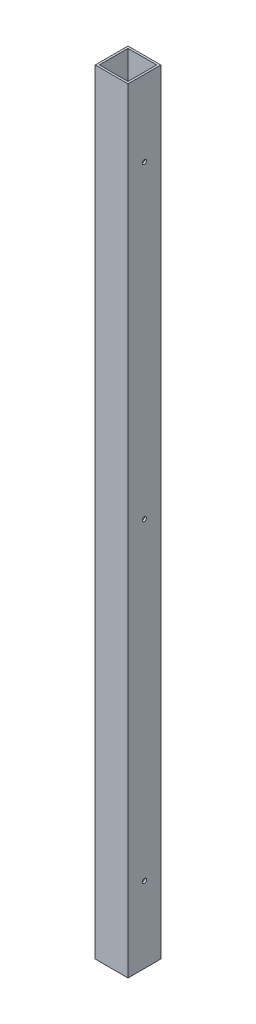
ISO-10303-21;
HEADER;
FILE_DESCRIPTION(('STEP AP214'),'2;1');
FILE_NAME('part.step','',(''),(''),'','','');
FILE_SCHEMA(('AUTOMOTIVE_DESIGN { 1 0 10303 214 1 1 1 1 }'));
ENDSEC;
DATA;
#1=APPLICATION_CONTEXT('core data for automotive mechanical design processes');
#2=APPLICATION_PROTOCOL_DEFINITION('international standard','automotive_design',2000,#1);
#3=PRODUCT_CONTEXT('',#1,'mechanical');
#4=PRODUCT('Part','Part','',(#3));
#5=PRODUCT_RELATED_PRODUCT_CATEGORY('part','',(#4));
#6=PRODUCT_DEFINITION_FORMATION('','',#4);
#7=PRODUCT_DEFINITION_CONTEXT('part definition',#1,'design');
#8=PRODUCT_DEFINITION('design','',#6,#7);
#9=PRODUCT_DEFINITION_SHAPE('','',#8);
#10=(LENGTH_UNIT() NAMED_UNIT(*) SI_UNIT(.MILLI.,.METRE.));
#11=(NAMED_UNIT(*) PLANE_ANGLE_UNIT() SI_UNIT($,.RADIAN.));
#12=(NAMED_UNIT(*) SI_UNIT($,.STERADIAN.) SOLID_ANGLE_UNIT());
#13=UNCERTAINTY_MEASURE_WITH_UNIT(LENGTH_MEASURE(1.E-05),#10,'distance_accuracy_value','');
#14=(GEOMETRIC_REPRESENTATION_CONTEXT(3) GLOBAL_UNCERTAINTY_ASSIGNED_CONTEXT((#13)) GLOBAL_UNIT_ASSIGNED_CONTEXT((#10,
#11,#12)) REPRESENTATION_CONTEXT('',''));
#15=CARTESIAN_POINT('',(0.,0.,0.));
#16=DIRECTION('',(0.,0.,1.));
#17=DIRECTION('',(1.,0.,0.));
#18=AXIS2_PLACEMENT_3D('',#15,#16,#17);
#19=CARTESIAN_POINT('',(0.,1200.14999999999,0.));
#20=DIRECTION('',(0.,0.999999999999993,0.));
#21=DIRECTION('',(0.,0.,0.999999999999993));
#22=AXIS2_PLACEMENT_3D('',#19,#20,#21);
#23=PLANE('',#22);
#24=DIRECTION('',(0.,0.,0.999999999999993));
#25=VECTOR('',#24,1.);
#26=CARTESIAN_POINT('',(-25.4000000000002,1200.14999999999,25.3999999999998));
#27=LINE('',#26,#25);
#28=CARTESIAN_POINT('',(-25.4,1200.14999999999,-25.3999999999998));
#29=VERTEX_POINT('',#28);
#30=CARTESIAN_POINT('',(-25.4000000000002,1200.14999999999,25.3999999999998));
#31=VERTEX_POINT('',#30);
#32=EDGE_CURVE('E139',#29,#31,#27,.T.);
#33=ORIENTED_EDGE('',*,*,#32,.T.);
#34=DIRECTION('',(1.,0.,0.));
#35=VECTOR('',#34,1.);
#36=CARTESIAN_POINT('',(25.3999999999998,1200.14999999999,25.3999999999998));
#37=LINE('',#36,#35);
#38=CARTESIAN_POINT('',(25.3999999999998,1200.14999999999,25.3999999999998));
#39=VERTEX_POINT('',#38);
#40=EDGE_CURVE('E142',#31,#39,#37,.T.);
#41=ORIENTED_EDGE('',*,*,#40,.T.);
#42=DIRECTION('',(0.,0.,-0.999999999999993));
#43=VECTOR('',#42,1.);
#44=CARTESIAN_POINT('',(25.3999999999998,1200.14999999999,25.3999999999998));
#45=LINE('',#44,#43);
#46=CARTESIAN_POINT('',(25.4,1200.14999999999,-25.3999999999998));
#47=VERTEX_POINT('',#46);
#48=EDGE_CURVE('E145',#39,#47,#45,.T.);
#49=ORIENTED_EDGE('',*,*,#48,.T.);
#50=DIRECTION('',(-1.,0.,0.));
#51=VECTOR('',#50,1.);
#52=CARTESIAN_POINT('',(25.4,1200.14999999999,-25.3999999999998));
#53=LINE('',#52,#51);
#54=EDGE_CURVE('E147',#47,#29,#53,.T.);
#55=ORIENTED_EDGE('',*,*,#54,.T.);
#56=EDGE_LOOP('',(#33,#41,#49,#55));
#57=FACE_BOUND('',#56,.T.);
#58=DIRECTION('',(0.,0.,-0.999999999999993));
#59=VECTOR('',#58,1.);
#60=CARTESIAN_POINT('',(22.2249999999997,1200.14999999999,22.2249999999998));
#61=LINE('',#60,#59);
#62=CARTESIAN_POINT('',(22.2249999999997,1200.14999999999,22.2249999999998));
#63=VERTEX_POINT('',#62);
#64=CARTESIAN_POINT('',(22.225,1200.14999999999,-22.2249999999999));
#65=VERTEX_POINT('',#64);
#66=EDGE_CURVE('E109',#63,#65,#61,.T.);
#67=ORIENTED_EDGE('',*,*,#66,.F.);
#68=DIRECTION('',(1.,0.,0.));
#69=VECTOR('',#68,1.);
#70=CARTESIAN_POINT('',(22.2249999999997,1200.14999999999,22.2249999999998));
#71=LINE('',#70,#69);
#72=CARTESIAN_POINT('',(-22.2250000000002,1200.14999999999,22.2249999999999));
#73=VERTEX_POINT('',#72);
#74=EDGE_CURVE('E101',#73,#63,#71,.T.);
#75=ORIENTED_EDGE('',*,*,#74,.F.);
#76=DIRECTION('',(0.,0.,0.999999999999993));
#77=VECTOR('',#76,1.);
#78=CARTESIAN_POINT('',(-22.2250000000002,1200.14999999999,22.2249999999999));
#79=LINE('',#78,#77);
#80=CARTESIAN_POINT('',(-22.225,1200.14999999999,-22.2249999999998));
#81=VERTEX_POINT('',#80);
#82=EDGE_CURVE('E123',#81,#73,#79,.T.);
#83=ORIENTED_EDGE('',*,*,#82,.F.);
#84=DIRECTION('',(-1.,0.,0.));
#85=VECTOR('',#84,1.);
#86=CARTESIAN_POINT('',(22.225,1200.14999999999,-22.2249999999999));
#87=LINE('',#86,#85);
#88=EDGE_CURVE('E121',#65,#81,#87,.T.);
#89=ORIENTED_EDGE('',*,*,#88,.F.);
#90=EDGE_LOOP('',(#67,#75,#83,#89));
#91=FACE_BOUND('',#90,.T.);
#92=ADVANCED_FACE('F34',(#57,#91),#23,.T.);
#93=CARTESIAN_POINT('',(0.,0.,0.));
#94=DIRECTION('',(0.,0.999999999999993,0.));
#95=DIRECTION('',(0.,0.,0.999999999999993));
#96=AXIS2_PLACEMENT_3D('',#93,#94,#95);
#97=PLANE('',#96);
#98=DIRECTION('',(0.,0.,0.999999999999993));
#99=VECTOR('',#98,1.);
#100=CARTESIAN_POINT('',(-25.4,0.,25.3999999999998));
#101=LINE('',#100,#99);
#102=CARTESIAN_POINT('',(-25.4,0.,-25.3999999999998));
#103=VERTEX_POINT('',#102);
#104=CARTESIAN_POINT('',(-25.4,0.,25.3999999999998));
#105=VERTEX_POINT('',#104);
#106=EDGE_CURVE('E117',#103,#105,#101,.T.);
#107=ORIENTED_EDGE('',*,*,#106,.F.);
#108=DIRECTION('',(-1.,0.,0.));
#109=VECTOR('',#108,1.);
#110=CARTESIAN_POINT('',(25.4,0.,-25.3999999999998));
#111=LINE('',#110,#109);
#112=CARTESIAN_POINT('',(25.4,0.,-25.3999999999998));
#113=VERTEX_POINT('',#112);
#114=EDGE_CURVE('E143',#113,#103,#111,.T.);
#115=ORIENTED_EDGE('',*,*,#114,.F.);
#116=DIRECTION('',(0.,0.,-0.999999999999993));
#117=VECTOR('',#116,1.);
#118=CARTESIAN_POINT('',(25.4,0.,25.3999999999998));
#119=LINE('',#118,#117);
#120=CARTESIAN_POINT('',(25.4,0.,25.3999999999998));
#121=VERTEX_POINT('',#120);
#122=EDGE_CURVE('E154',#121,#113,#119,.T.);
#123=ORIENTED_EDGE('',*,*,#122,.F.);
#124=DIRECTION('',(1.,0.,0.));
#125=VECTOR('',#124,1.);
#126=CARTESIAN_POINT('',(25.4,0.,25.3999999999998));
#127=LINE('',#126,#125);
#128=EDGE_CURVE('E152',#105,#121,#127,.T.);
#129=ORIENTED_EDGE('',*,*,#128,.F.);
#130=EDGE_LOOP('',(#107,#115,#123,#129));
#131=FACE_BOUND('',#130,.T.);
#132=DIRECTION('',(1.,0.,0.));
#133=VECTOR('',#132,1.);
#134=CARTESIAN_POINT('',(22.225,0.,22.2249999999999));
#135=LINE('',#134,#133);
#136=CARTESIAN_POINT('',(-22.225,0.,22.2249999999998));
#137=VERTEX_POINT('',#136);
#138=CARTESIAN_POINT('',(22.225,0.,22.2249999999999));
#139=VERTEX_POINT('',#138);
#140=EDGE_CURVE('E59',#137,#139,#135,.T.);
#141=ORIENTED_EDGE('',*,*,#140,.T.);
#142=DIRECTION('',(0.,0.,-0.999999999999993));
#143=VECTOR('',#142,1.);
#144=CARTESIAN_POINT('',(22.225,0.,22.2249999999999));
#145=LINE('',#144,#143);
#146=CARTESIAN_POINT('',(22.225,0.,-22.2249999999998));
#147=VERTEX_POINT('',#146);
#148=EDGE_CURVE('E116',#139,#147,#145,.T.);
#149=ORIENTED_EDGE('',*,*,#148,.T.);
#150=DIRECTION('',(-1.,0.,0.));
#151=VECTOR('',#150,1.);
#152=CARTESIAN_POINT('',(22.225,0.,-22.2249999999998));
#153=LINE('',#152,#151);
#154=CARTESIAN_POINT('',(-22.225,0.,-22.2249999999998));
#155=VERTEX_POINT('',#154);
#156=EDGE_CURVE('E131',#147,#155,#153,.T.);
#157=ORIENTED_EDGE('',*,*,#156,.T.);
#158=DIRECTION('',(0.,0.,0.999999999999993));
#159=VECTOR('',#158,1.);
#160=CARTESIAN_POINT('',(-22.225,0.,22.2249999999998));
#161=LINE('',#160,#159);
#162=EDGE_CURVE('E110',#155,#137,#161,.T.);
#163=ORIENTED_EDGE('',*,*,#162,.T.);
#164=EDGE_LOOP('',(#141,#149,#157,#163));
#165=FACE_BOUND('',#164,.T.);
#166=ADVANCED_FACE('F201',(#131,#165),#97,.F.);
#167=CARTESIAN_POINT('',(-25.4000000000002,1200.14999999999,25.3999999999998));
#168=DIRECTION('',(1.,0.,0.));
#169=DIRECTION('',(0.,0.,-0.999999999999993));
#170=AXIS2_PLACEMENT_3D('',#167,#168,#169);
#171=PLANE('',#170);
#172=CARTESIAN_POINT('',(-25.4,1082.54799999999,0.));
#173=DIRECTION('',(1.,0.,0.));
#174=DIRECTION('',(0.,0.,-0.999999999999993));
#175=AXIS2_PLACEMENT_3D('',#172,#173,#174);
#176=CIRCLE('',#175,3.30200000000001);
#177=CARTESIAN_POINT('',(-25.4,1082.54799999999,-3.30199999999997));
#178=VERTEX_POINT('',#177);
#179=EDGE_CURVE('E251',#178,#178,#176,.T.);
#180=ORIENTED_EDGE('',*,*,#179,.T.);
#181=EDGE_LOOP('',(#180));
#182=FACE_BOUND('',#181,.T.);
#183=CARTESIAN_POINT('',(-25.4,117.602,0.));
#184=DIRECTION('',(1.,0.,0.));
#185=DIRECTION('',(0.,0.,-0.999999999999993));
#186=AXIS2_PLACEMENT_3D('',#183,#184,#185);
#187=CIRCLE('',#186,3.302);
#188=CARTESIAN_POINT('',(-25.4,117.602,-3.30199999999994));
#189=VERTEX_POINT('',#188);
#190=EDGE_CURVE('E255',#189,#189,#187,.T.);
#191=ORIENTED_EDGE('',*,*,#190,.T.);
#192=EDGE_LOOP('',(#191));
#193=FACE_BOUND('',#192,.T.);
#194=CARTESIAN_POINT('',(-25.4000000000003,603.249999999996,0.));
#195=DIRECTION('',(1.,0.,0.));
#196=DIRECTION('',(0.,0.,-0.999999999999993));
#197=AXIS2_PLACEMENT_3D('',#194,#195,#196);
#198=CIRCLE('',#197,3.30200000000001);
#199=CARTESIAN_POINT('',(-25.4000000000003,603.249999999996,-3.30199999999999));
#200=VERTEX_POINT('',#199);
#201=EDGE_CURVE('E167',#200,#200,#198,.T.);
#202=ORIENTED_EDGE('',*,*,#201,.T.);
#203=EDGE_LOOP('',(#202));
#204=FACE_BOUND('',#203,.T.);
#205=ORIENTED_EDGE('',*,*,#106,.T.);
#206=DIRECTION('',(0.,-0.999999999999993,0.));
#207=VECTOR('',#206,1.);
#208=CARTESIAN_POINT('',(-25.4000000000002,1200.14999999999,25.3999999999998));
#209=LINE('',#208,#207);
#210=EDGE_CURVE('E11',#31,#105,#209,.T.);
#211=ORIENTED_EDGE('',*,*,#210,.F.);
#212=ORIENTED_EDGE('',*,*,#32,.F.);
#213=DIRECTION('',(0.,-0.999999999999993,0.));
#214=VECTOR('',#213,1.);
#215=CARTESIAN_POINT('',(-25.4,1200.14999999999,-25.3999999999998));
#216=LINE('',#215,#214);
#217=EDGE_CURVE('E149',#29,#103,#216,.T.);
#218=ORIENTED_EDGE('',*,*,#217,.T.);
#219=EDGE_LOOP('',(#205,#211,#212,#218));
#220=FACE_BOUND('',#219,.T.);
#221=ADVANCED_FACE('F36',(#182,#193,#204,#220),#171,.F.);
#222=CARTESIAN_POINT('',(25.3999999999998,1200.14999999999,25.3999999999998));
#223=DIRECTION('',(0.,0.,-0.999999999999993));
#224=DIRECTION('',(-1.,0.,0.));
#225=AXIS2_PLACEMENT_3D('',#222,#223,#224);
#226=PLANE('',#225);
#227=ORIENTED_EDGE('',*,*,#128,.T.);
#228=DIRECTION('',(0.,-0.999999999999993,0.));
#229=VECTOR('',#228,1.);
#230=CARTESIAN_POINT('',(25.3999999999998,1200.14999999999,25.3999999999998));
#231=LINE('',#230,#229);
#232=EDGE_CURVE('E43',#39,#121,#231,.T.);
#233=ORIENTED_EDGE('',*,*,#232,.F.);
#234=ORIENTED_EDGE('',*,*,#40,.F.);
#235=ORIENTED_EDGE('',*,*,#210,.T.);
#236=EDGE_LOOP('',(#227,#233,#234,#235));
#237=FACE_BOUND('',#236,.T.);
#238=ADVANCED_FACE('F226',(#237),#226,.F.);
#239=CARTESIAN_POINT('',(25.3999999999998,1200.14999999999,25.3999999999998));
#240=DIRECTION('',(-1.,0.,0.));
#241=DIRECTION('',(0.,0.,0.999999999999993));
#242=AXIS2_PLACEMENT_3D('',#239,#240,#241);
#243=PLANE('',#242);
#244=CARTESIAN_POINT('',(25.3999999999998,1082.54799999999,0.));
#245=DIRECTION('',(1.,0.,0.));
#246=DIRECTION('',(0.,0.,-0.999999999999993));
#247=AXIS2_PLACEMENT_3D('',#244,#245,#246);
#248=CIRCLE('',#247,3.30200000000001);
#249=CARTESIAN_POINT('',(25.3999999999998,1082.54799999999,-3.30199999999997));
#250=VERTEX_POINT('',#249);
#251=EDGE_CURVE('E261',#250,#250,#248,.T.);
#252=ORIENTED_EDGE('',*,*,#251,.F.);
#253=EDGE_LOOP('',(#252));
#254=FACE_BOUND('',#253,.T.);
#255=CARTESIAN_POINT('',(25.4,117.602,0.));
#256=DIRECTION('',(1.,0.,0.));
#257=DIRECTION('',(0.,0.,-0.999999999999993));
#258=AXIS2_PLACEMENT_3D('',#255,#256,#257);
#259=CIRCLE('',#258,3.302);
#260=CARTESIAN_POINT('',(25.4,117.602,-3.30199999999994));
#261=VERTEX_POINT('',#260);
#262=EDGE_CURVE('E265',#261,#261,#259,.T.);
#263=ORIENTED_EDGE('',*,*,#262,.F.);
#264=EDGE_LOOP('',(#263));
#265=FACE_BOUND('',#264,.T.);
#266=CARTESIAN_POINT('',(25.3999999999998,603.249999999996,0.));
#267=DIRECTION('',(1.,0.,0.));
#268=DIRECTION('',(0.,0.,-0.999999999999993));
#269=AXIS2_PLACEMENT_3D('',#266,#267,#268);
#270=CIRCLE('',#269,3.30200000000001);
#271=CARTESIAN_POINT('',(25.3999999999998,603.249999999996,-3.30199999999999));
#272=VERTEX_POINT('',#271);
#273=EDGE_CURVE('E180',#272,#272,#270,.T.);
#274=ORIENTED_EDGE('',*,*,#273,.F.);
#275=EDGE_LOOP('',(#274));
#276=FACE_BOUND('',#275,.T.);
#277=ORIENTED_EDGE('',*,*,#122,.T.);
#278=DIRECTION('',(0.,-0.999999999999993,0.));
#279=VECTOR('',#278,1.);
#280=CARTESIAN_POINT('',(25.4,1200.14999999999,-25.3999999999998));
#281=LINE('',#280,#279);
#282=EDGE_CURVE('E159',#47,#113,#281,.T.);
#283=ORIENTED_EDGE('',*,*,#282,.F.);
#284=ORIENTED_EDGE('',*,*,#48,.F.);
#285=ORIENTED_EDGE('',*,*,#232,.T.);
#286=EDGE_LOOP('',(#277,#283,#284,#285));
#287=FACE_BOUND('',#286,.T.);
#288=ADVANCED_FACE('F223',(#254,#265,#276,#287),#243,.F.);
#289=CARTESIAN_POINT('',(25.4,1200.14999999999,-25.3999999999998));
#290=DIRECTION('',(0.,0.,0.999999999999993));
#291=DIRECTION('',(1.,0.,0.));
#292=AXIS2_PLACEMENT_3D('',#289,#290,#291);
#293=PLANE('',#292);
#294=ORIENTED_EDGE('',*,*,#114,.T.);
#295=ORIENTED_EDGE('',*,*,#217,.F.);
#296=ORIENTED_EDGE('',*,*,#54,.F.);
#297=ORIENTED_EDGE('',*,*,#282,.T.);
#298=EDGE_LOOP('',(#294,#295,#296,#297));
#299=FACE_BOUND('',#298,.T.);
#300=ADVANCED_FACE('F220',(#299),#293,.F.);
#301=CARTESIAN_POINT('',(22.2249999999997,1200.14999999999,22.2249999999998));
#302=DIRECTION('',(0.,0.,-0.999999999999993));
#303=DIRECTION('',(-1.,0.,0.));
#304=AXIS2_PLACEMENT_3D('',#301,#302,#303);
#305=PLANE('',#304);
#306=ORIENTED_EDGE('',*,*,#140,.F.);
#307=DIRECTION('',(0.,-0.999999999999993,0.));
#308=VECTOR('',#307,1.);
#309=CARTESIAN_POINT('',(-22.2250000000002,1200.14999999999,22.2249999999999));
#310=LINE('',#309,#308);
#311=EDGE_CURVE('E105',#73,#137,#310,.T.);
#312=ORIENTED_EDGE('',*,*,#311,.F.);
#313=ORIENTED_EDGE('',*,*,#74,.T.);
#314=DIRECTION('',(0.,-0.999999999999993,0.));
#315=VECTOR('',#314,1.);
#316=CARTESIAN_POINT('',(22.2249999999997,1200.14999999999,22.2249999999998));
#317=LINE('',#316,#315);
#318=EDGE_CURVE('E104',#63,#139,#317,.T.);
#319=ORIENTED_EDGE('',*,*,#318,.T.);
#320=EDGE_LOOP('',(#306,#312,#313,#319));
#321=FACE_BOUND('',#320,.T.);
#322=ADVANCED_FACE('F103',(#321),#305,.T.);
#323=CARTESIAN_POINT('',(22.2249999999997,1200.14999999999,22.2249999999998));
#324=DIRECTION('',(-1.,0.,0.));
#325=DIRECTION('',(0.,0.,0.999999999999993));
#326=AXIS2_PLACEMENT_3D('',#323,#324,#325);
#327=PLANE('',#326);
#328=CARTESIAN_POINT('',(22.2249999999998,1082.54799999999,0.));
#329=DIRECTION('',(-1.,0.,0.));
#330=DIRECTION('',(0.,0.,0.999999999999993));
#331=AXIS2_PLACEMENT_3D('',#328,#329,#330);
#332=CIRCLE('',#331,3.30200000000001);
#333=CARTESIAN_POINT('',(22.2249999999998,1082.54799999999,3.30200000000002));
#334=VERTEX_POINT('',#333);
#335=EDGE_CURVE('E129',#334,#334,#332,.T.);
#336=ORIENTED_EDGE('',*,*,#335,.F.);
#337=EDGE_LOOP('',(#336));
#338=FACE_BOUND('',#337,.T.);
#339=CARTESIAN_POINT('',(22.225,117.602,0.));
#340=DIRECTION('',(-1.,0.,0.));
#341=DIRECTION('',(0.,0.,0.999999999999993));
#342=AXIS2_PLACEMENT_3D('',#339,#340,#341);
#343=CIRCLE('',#342,3.302);
#344=CARTESIAN_POINT('',(22.225,117.602,3.30200000000001));
#345=VERTEX_POINT('',#344);
#346=EDGE_CURVE('E170',#345,#345,#343,.T.);
#347=ORIENTED_EDGE('',*,*,#346,.F.);
#348=EDGE_LOOP('',(#347));
#349=FACE_BOUND('',#348,.T.);
#350=CARTESIAN_POINT('',(22.2249999999997,603.249999999996,0.));
#351=DIRECTION('',(-1.,0.,0.));
#352=DIRECTION('',(0.,0.,0.999999999999993));
#353=AXIS2_PLACEMENT_3D('',#350,#351,#352);
#354=CIRCLE('',#353,3.30200000000001);
#355=CARTESIAN_POINT('',(22.2249999999997,603.249999999996,3.30199999999999));
#356=VERTEX_POINT('',#355);
#357=EDGE_CURVE('E166',#356,#356,#354,.T.);
#358=ORIENTED_EDGE('',*,*,#357,.F.);
#359=EDGE_LOOP('',(#358));
#360=FACE_BOUND('',#359,.T.);
#361=ORIENTED_EDGE('',*,*,#148,.F.);
#362=ORIENTED_EDGE('',*,*,#318,.F.);
#363=ORIENTED_EDGE('',*,*,#66,.T.);
#364=DIRECTION('',(0.,-0.999999999999993,0.));
#365=VECTOR('',#364,1.);
#366=CARTESIAN_POINT('',(22.225,1200.14999999999,-22.2249999999999));
#367=LINE('',#366,#365);
#368=EDGE_CURVE('E118',#65,#147,#367,.T.);
#369=ORIENTED_EDGE('',*,*,#368,.T.);
#370=EDGE_LOOP('',(#361,#362,#363,#369));
#371=FACE_BOUND('',#370,.T.);
#372=ADVANCED_FACE('F113',(#338,#349,#360,#371),#327,.T.);
#373=CARTESIAN_POINT('',(22.225,1200.14999999999,-22.2249999999999));
#374=DIRECTION('',(0.,0.,0.999999999999993));
#375=DIRECTION('',(1.,0.,0.));
#376=AXIS2_PLACEMENT_3D('',#373,#374,#375);
#377=PLANE('',#376);
#378=ORIENTED_EDGE('',*,*,#156,.F.);
#379=ORIENTED_EDGE('',*,*,#368,.F.);
#380=ORIENTED_EDGE('',*,*,#88,.T.);
#381=DIRECTION('',(0.,-0.999999999999993,0.));
#382=VECTOR('',#381,1.);
#383=CARTESIAN_POINT('',(-22.225,1200.14999999999,-22.2249999999998));
#384=LINE('',#383,#382);
#385=EDGE_CURVE('E51',#81,#155,#384,.T.);
#386=ORIENTED_EDGE('',*,*,#385,.T.);
#387=EDGE_LOOP('',(#378,#379,#380,#386));
#388=FACE_BOUND('',#387,.T.);
#389=ADVANCED_FACE('F195',(#388),#377,.T.);
#390=CARTESIAN_POINT('',(-22.2250000000002,1200.14999999999,22.2249999999999));
#391=DIRECTION('',(1.,0.,0.));
#392=DIRECTION('',(0.,0.,-0.999999999999993));
#393=AXIS2_PLACEMENT_3D('',#390,#391,#392);
#394=PLANE('',#393);
#395=CARTESIAN_POINT('',(-22.225,1082.54799999999,0.));
#396=DIRECTION('',(1.,0.,0.));
#397=DIRECTION('',(0.,0.,-0.999999999999993));
#398=AXIS2_PLACEMENT_3D('',#395,#396,#397);
#399=CIRCLE('',#398,3.30200000000001);
#400=CARTESIAN_POINT('',(-22.225,1082.54799999999,-3.30199999999997));
#401=VERTEX_POINT('',#400);
#402=EDGE_CURVE('E38',#401,#401,#399,.T.);
#403=ORIENTED_EDGE('',*,*,#402,.F.);
#404=EDGE_LOOP('',(#403));
#405=FACE_BOUND('',#404,.T.);
#406=CARTESIAN_POINT('',(-22.225,117.602,0.));
#407=DIRECTION('',(1.,0.,0.));
#408=DIRECTION('',(0.,0.,-0.999999999999993));
#409=AXIS2_PLACEMENT_3D('',#406,#407,#408);
#410=CIRCLE('',#409,3.302);
#411=CARTESIAN_POINT('',(-22.225,117.602,-3.30199999999994));
#412=VERTEX_POINT('',#411);
#413=EDGE_CURVE('E168',#412,#412,#410,.T.);
#414=ORIENTED_EDGE('',*,*,#413,.F.);
#415=EDGE_LOOP('',(#414));
#416=FACE_BOUND('',#415,.T.);
#417=CARTESIAN_POINT('',(-22.2250000000002,603.249999999996,0.));
#418=DIRECTION('',(1.,0.,0.));
#419=DIRECTION('',(0.,0.,-0.999999999999993));
#420=AXIS2_PLACEMENT_3D('',#417,#418,#419);
#421=CIRCLE('',#420,3.30200000000001);
#422=CARTESIAN_POINT('',(-22.2250000000002,603.249999999996,-3.30199999999999));
#423=VERTEX_POINT('',#422);
#424=EDGE_CURVE('E164',#423,#423,#421,.T.);
#425=ORIENTED_EDGE('',*,*,#424,.F.);
#426=EDGE_LOOP('',(#425));
#427=FACE_BOUND('',#426,.T.);
#428=ORIENTED_EDGE('',*,*,#162,.F.);
#429=ORIENTED_EDGE('',*,*,#385,.F.);
#430=ORIENTED_EDGE('',*,*,#82,.T.);
#431=ORIENTED_EDGE('',*,*,#311,.T.);
#432=EDGE_LOOP('',(#428,#429,#430,#431));
#433=FACE_BOUND('',#432,.T.);
#434=ADVANCED_FACE('F191',(#405,#416,#427,#433),#394,.T.);
#435=CARTESIAN_POINT('',(-25.4000000000003,603.249999999996,0.));
#436=DIRECTION('',(1.,0.,0.));
#437=DIRECTION('',(0.,0.,-0.999999999999993));
#438=AXIS2_PLACEMENT_3D('',#435,#436,#437);
#439=CYLINDRICAL_SURFACE('',#438,3.30200000000001);
#440=ORIENTED_EDGE('',*,*,#424,.T.);
#441=EDGE_LOOP('',(#440));
#442=FACE_BOUND('',#441,.T.);
#443=ORIENTED_EDGE('',*,*,#201,.F.);
#444=EDGE_LOOP('',(#443));
#445=FACE_BOUND('',#444,.T.);
#446=ADVANCED_FACE('F194',(#442,#445),#439,.F.);
#447=CARTESIAN_POINT('',(-25.4,117.602,0.));
#448=DIRECTION('',(1.,0.,0.));
#449=DIRECTION('',(0.,0.,-0.999999999999993));
#450=AXIS2_PLACEMENT_3D('',#447,#448,#449);
#451=CYLINDRICAL_SURFACE('',#450,3.302);
#452=ORIENTED_EDGE('',*,*,#413,.T.);
#453=EDGE_LOOP('',(#452));
#454=FACE_BOUND('',#453,.T.);
#455=ORIENTED_EDGE('',*,*,#190,.F.);
#456=EDGE_LOOP('',(#455));
#457=FACE_BOUND('',#456,.T.);
#458=ADVANCED_FACE('F285',(#454,#457),#451,.F.);
#459=CARTESIAN_POINT('',(-25.4,1082.54799999999,0.));
#460=DIRECTION('',(1.,0.,0.));
#461=DIRECTION('',(0.,0.,-0.999999999999993));
#462=AXIS2_PLACEMENT_3D('',#459,#460,#461);
#463=CYLINDRICAL_SURFACE('',#462,3.30200000000001);
#464=ORIENTED_EDGE('',*,*,#402,.T.);
#465=EDGE_LOOP('',(#464));
#466=FACE_BOUND('',#465,.T.);
#467=ORIENTED_EDGE('',*,*,#179,.F.);
#468=EDGE_LOOP('',(#467));
#469=FACE_BOUND('',#468,.T.);
#470=ADVANCED_FACE('F188',(#466,#469),#463,.F.);
#471=ORIENTED_EDGE('',*,*,#357,.T.);
#472=EDGE_LOOP('',(#471));
#473=FACE_BOUND('',#472,.T.);
#474=ORIENTED_EDGE('',*,*,#273,.T.);
#475=EDGE_LOOP('',(#474));
#476=FACE_BOUND('',#475,.T.);
#477=ADVANCED_FACE('F275',(#473,#476),#439,.F.);
#478=ORIENTED_EDGE('',*,*,#346,.T.);
#479=EDGE_LOOP('',(#478));
#480=FACE_BOUND('',#479,.T.);
#481=ORIENTED_EDGE('',*,*,#262,.T.);
#482=EDGE_LOOP('',(#481));
#483=FACE_BOUND('',#482,.T.);
#484=ADVANCED_FACE('F270',(#480,#483),#451,.F.);
#485=ORIENTED_EDGE('',*,*,#335,.T.);
#486=EDGE_LOOP('',(#485));
#487=FACE_BOUND('',#486,.T.);
#488=ORIENTED_EDGE('',*,*,#251,.T.);
#489=EDGE_LOOP('',(#488));
#490=FACE_BOUND('',#489,.T.);
#491=ADVANCED_FACE('F282',(#487,#490),#463,.F.);
#492=CLOSED_SHELL('',(#92,#166,#221,#238,#288,#300,#322,#372,#389,#434,#446,#458,#470,#477,#484,#491));
#493=MANIFOLD_SOLID_BREP('B2',#492);
#494=ADVANCED_BREP_SHAPE_REPRESENTATION('',(#18,#493),#14);
#495=SHAPE_DEFINITION_REPRESENTATION(#9,#494);
ENDSEC;
END-ISO-10303-21;
